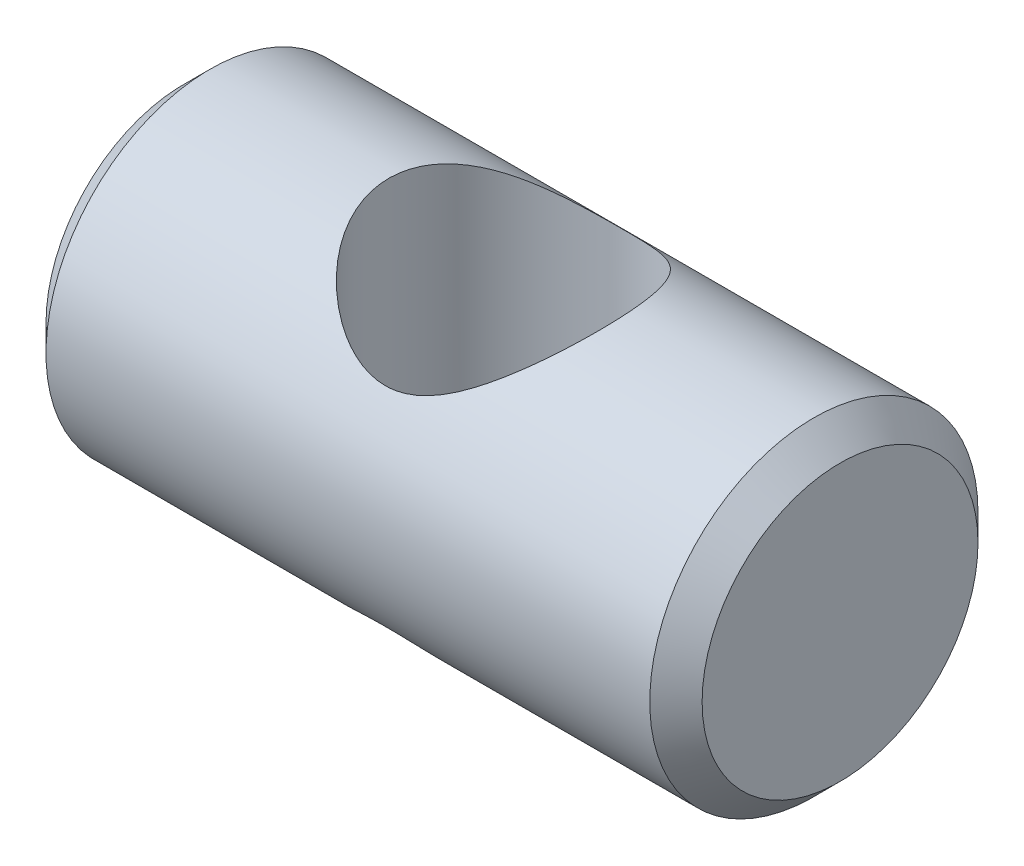
ISO-10303-21;
HEADER;
FILE_DESCRIPTION(('STEP AP214'),'2;1');
FILE_NAME('part.step','',(''),(''),'','','');
FILE_SCHEMA(('AUTOMOTIVE_DESIGN { 1 0 10303 214 1 1 1 1 }'));
ENDSEC;
DATA;
#1=APPLICATION_CONTEXT('core data for automotive mechanical design processes');
#2=APPLICATION_PROTOCOL_DEFINITION('international standard','automotive_design',2000,#1);
#3=PRODUCT_CONTEXT('',#1,'mechanical');
#4=PRODUCT('Part','Part','',(#3));
#5=PRODUCT_RELATED_PRODUCT_CATEGORY('part','',(#4));
#6=PRODUCT_DEFINITION_FORMATION('','',#4);
#7=PRODUCT_DEFINITION_CONTEXT('part definition',#1,'design');
#8=PRODUCT_DEFINITION('design','',#6,#7);
#9=PRODUCT_DEFINITION_SHAPE('','',#8);
#10=(LENGTH_UNIT() NAMED_UNIT(*) SI_UNIT(.MILLI.,.METRE.));
#11=(NAMED_UNIT(*) PLANE_ANGLE_UNIT() SI_UNIT($,.RADIAN.));
#12=(NAMED_UNIT(*) SI_UNIT($,.STERADIAN.) SOLID_ANGLE_UNIT());
#13=UNCERTAINTY_MEASURE_WITH_UNIT(LENGTH_MEASURE(1.E-05),#10,'distance_accuracy_value','');
#14=(GEOMETRIC_REPRESENTATION_CONTEXT(3) GLOBAL_UNCERTAINTY_ASSIGNED_CONTEXT((#13)) GLOBAL_UNIT_ASSIGNED_CONTEXT((#10,
#11,#12)) REPRESENTATION_CONTEXT('',''));
#15=CARTESIAN_POINT('',(0.,0.,0.));
#16=DIRECTION('',(0.,0.,1.));
#17=DIRECTION('',(1.,0.,0.));
#18=AXIS2_PLACEMENT_3D('',#15,#16,#17);
#19=CARTESIAN_POINT('',(9.525,0.,0.));
#20=DIRECTION('',(-1.,0.,0.));
#21=DIRECTION('',(0.,0.,1.));
#22=AXIS2_PLACEMENT_3D('',#19,#20,#21);
#23=CYLINDRICAL_SURFACE('',#22,4.765);
#24=CARTESIAN_POINT('',(0.,-3.0270158572429,3.68));
#25=CARTESIAN_POINT('',(0.0785672773316467,-3.02701614791727,3.67999984364138));
#26=CARTESIAN_POINT('',(0.157136135576355,-3.03031605642996,3.67729277636747));
#27=CARTESIAN_POINT('',(0.313369541449519,-3.04330147157753,3.66655295600809));
#28=CARTESIAN_POINT('',(0.391034010912772,-3.05298752605126,3.65851974601636));
#29=CARTESIAN_POINT('',(0.544942339151607,-3.07820352988238,3.63732812874269));
#30=CARTESIAN_POINT('',(0.621180877977562,-3.09375201630091,3.62415345944192));
#31=CARTESIAN_POINT('',(0.771468880528868,-3.12988210454059,3.59299821855179));
#32=CARTESIAN_POINT('',(0.845516665983408,-3.15046745848851,3.57501406328682));
#33=CARTESIAN_POINT('',(1.09433047382612,-3.22791462831318,3.50587087765695));
#34=CARTESIAN_POINT('',(1.26309282362243,-3.2948386580286,3.44382003292069));
#35=CARTESIAN_POINT('',(1.50370711041474,-3.40467601246938,3.33408533723918));
#36=CARTESIAN_POINT('',(1.58189244838755,-3.44290479326835,3.29468500807197));
#37=CARTESIAN_POINT('',(1.73423285237257,-3.52148653298938,3.21055545325705));
#38=CARTESIAN_POINT('',(1.80838881793449,-3.56183901380659,3.16582742418489));
#39=CARTESIAN_POINT('',(2.02850482582812,-3.68672600847629,3.02153691887044));
#40=CARTESIAN_POINT('',(2.16807869449588,-3.77315168849593,2.9137218740972));
#41=CARTESIAN_POINT('',(2.42959010373284,-3.94426933228633,2.67754924945123));
#42=CARTESIAN_POINT('',(2.55153658554773,-4.0289621561759,2.54920215427041));
#43=CARTESIAN_POINT('',(2.77693730786715,-4.1919505214112,2.27132648174837));
#44=CARTESIAN_POINT('',(2.88023478105728,-4.27018907543985,2.12163570850645));
#45=CARTESIAN_POINT('',(3.06369900830999,-4.41409842691616,1.80316374111448));
#46=CARTESIAN_POINT('',(3.14388622560065,-4.47978032533083,1.63439962117957));
#47=CARTESIAN_POINT('',(3.26635689009236,-4.58439476517905,1.30881127520956));
#48=CARTESIAN_POINT('',(3.3126324755552,-4.62591646772975,1.15433056577145));
#49=CARTESIAN_POINT('',(3.38325654959983,-4.69367027218436,0.83720228083025));
#50=CARTESIAN_POINT('',(3.40762001451853,-4.7199128126465,0.674560363681938));
#51=CARTESIAN_POINT('',(3.43267527752513,-4.75538994748078,0.345016918949483));
#52=CARTESIAN_POINT('',(3.43328564995364,-4.76456593536209,0.178102701594283));
#53=CARTESIAN_POINT('',(3.41018166140548,-4.76540378920208,-0.154080808504469));
#54=CARTESIAN_POINT('',(3.38646547727926,-4.75706434242047,-0.319349977022775));
#55=CARTESIAN_POINT('',(3.31775156953333,-4.72510260499364,-0.634317782486347));
#56=CARTESIAN_POINT('',(3.27397352746067,-4.70233080305011,-0.784375176401479));
#57=CARTESIAN_POINT('',(3.16750864597913,-4.64450941494238,-1.07505429218324));
#58=CARTESIAN_POINT('',(3.10481828431147,-4.60945754152293,-1.21567425043884));
#59=CARTESIAN_POINT('',(2.95652856255593,-4.52638674091887,-1.49677788855974));
#60=CARTESIAN_POINT('',(2.86942133720827,-4.47751111873768,-1.63620711351602));
#61=CARTESIAN_POINT('',(2.67788120319372,-4.37232420780869,-1.89951272145431));
#62=CARTESIAN_POINT('',(2.57343424063936,-4.31600689517522,-2.02337634423389));
#63=CARTESIAN_POINT('',(2.3299298971412,-4.18996971318213,-2.27426780979749));
#64=CARTESIAN_POINT('',(2.18800876851398,-4.11960732735628,-2.39819784816123));
#65=CARTESIAN_POINT('',(1.88505782163776,-3.98107848473248,-2.62174133186739));
#66=CARTESIAN_POINT('',(1.72402241690679,-3.91291267736107,-2.72134764203992));
#67=CARTESIAN_POINT('',(1.40961518716303,-3.79636450990898,-2.881168849186));
#68=CARTESIAN_POINT('',(1.25863725138286,-3.7465473111698,-2.94503209171547));
#69=CARTESIAN_POINT('',(0.945527440392475,-3.66060402226399,-3.05121747931763));
#70=CARTESIAN_POINT('',(0.783414037013451,-3.62445587601066,-3.09357436476774));
#71=CARTESIAN_POINT('',(0.53381305643861,-3.58476149841441,-3.13928376884266));
#72=CARTESIAN_POINT('',(0.449028547115522,-3.57393161480045,-3.15156761613341));
#73=CARTESIAN_POINT('',(0.278275024285709,-3.55780077117141,-3.16976872881678));
#74=CARTESIAN_POINT('',(0.192306660171832,-3.5524968934398,-3.17568935402606));
#75=CARTESIAN_POINT('',(0.0200327709043123,-3.54772147962291,-3.18102355866001));
#76=CARTESIAN_POINT('',(-0.0662726316081475,-3.54824798964232,-3.18043931801256));
#77=CARTESIAN_POINT('',(-0.238338872801629,-3.55508375410915,-3.17279435887041));
#78=CARTESIAN_POINT('',(-0.324099748085627,-3.56139261563451,-3.16573408043507));
#79=CARTESIAN_POINT('',(-0.553401842306178,-3.58576306843395,-3.13816835119393));
#80=CARTESIAN_POINT('',(-0.695739197403445,-3.60894237647337,-3.11173256017326));
#81=CARTESIAN_POINT('',(-0.973480788870412,-3.6678298405413,-3.04208625520151));
#82=CARTESIAN_POINT('',(-1.10887734054378,-3.70355155394913,-2.99885758403296));
#83=CARTESIAN_POINT('',(-1.42379146726814,-3.7997001514418,-2.87675019956371));
#84=CARTESIAN_POINT('',(-1.59919673865542,-3.86428769996493,-2.79052654374781));
#85=CARTESIAN_POINT('',(-1.93113815119942,-4.00059813210694,-2.59133845951309));
#86=CARTESIAN_POINT('',(-2.08764088718698,-4.07233325050109,-2.47832770642991));
#87=CARTESIAN_POINT('',(-2.38199709911894,-4.21579037939226,-2.22570370446708));
#88=CARTESIAN_POINT('',(-2.51955338419097,-4.28749766673045,-2.08573466326166));
#89=CARTESIAN_POINT('',(-2.77028243502779,-4.42234806198233,-1.78201502187867));
#90=CARTESIAN_POINT('',(-2.88349257282064,-4.48550424008068,-1.61830152645774));
#91=CARTESIAN_POINT('',(-3.06402610957439,-4.58658548395503,-1.30045140866569));
#92=CARTESIAN_POINT('',(-3.13591982023922,-4.62699541781642,-1.1497087789086));
#93=CARTESIAN_POINT('',(-3.25766051296821,-4.69370617156705,-0.836599849304387));
#94=CARTESIAN_POINT('',(-3.30752205037566,-4.7200163088041,-0.674241306034804));
#95=CARTESIAN_POINT('',(-3.3829870904449,-4.75572615385405,-0.341241432427479));
#96=CARTESIAN_POINT('',(-3.40846923089666,-4.7650414665297,-0.170563063438741));
#97=CARTESIAN_POINT('',(-3.4334390909829,-4.76495829995348,0.172677006169811));
#98=CARTESIAN_POINT('',(-3.43293306367628,-4.7555643228997,0.345238243758838));
#99=CARTESIAN_POINT('',(-3.40754400048731,-4.71998636563285,0.672126495727842));
#100=CARTESIAN_POINT('',(-3.38468468821344,-4.69525837988108,0.826779473459493));
#101=CARTESIAN_POINT('',(-3.31910619707247,-4.63193340521078,1.12882616508402));
#102=CARTESIAN_POINT('',(-3.27638180384756,-4.59333277548538,1.27621796175838));
#103=CARTESIAN_POINT('',(-3.17042951924722,-4.50215126554465,1.5686260572414));
#104=CARTESIAN_POINT('',(-3.10621371599284,-4.4489247354207,1.71307815224115));
#105=CARTESIAN_POINT('',(-2.96073945861412,-4.33272638873523,1.98874620073682));
#106=CARTESIAN_POINT('',(-2.87947919610231,-4.26975353829207,2.11996074756245));
#107=CARTESIAN_POINT('',(-2.68651050838254,-4.12556821291774,2.39003735747662));
#108=CARTESIAN_POINT('',(-2.57196063848181,-4.04309554925752,2.52618739114483));
#109=CARTESIAN_POINT('',(-2.32447412944916,-3.87408431941462,2.77844859407009));
#110=CARTESIAN_POINT('',(-2.19149095139183,-3.78753584009048,2.89450731580785));
#111=CARTESIAN_POINT('',(-1.96595276183287,-3.65130486353125,3.06263487303052));
#112=CARTESIAN_POINT('',(-1.87886470860018,-3.60090149373494,3.12157066922301));
#113=CARTESIAN_POINT('',(-1.69862262017004,-3.50236607543004,3.23173475735497));
#114=CARTESIAN_POINT('',(-1.60546616441238,-3.45423494663789,3.28295994638552));
#115=CARTESIAN_POINT('',(-1.41335402823623,-3.36225362869259,3.37709887635029));
#116=CARTESIAN_POINT('',(-1.31441341048654,-3.31839304937429,3.4200330530899));
#117=CARTESIAN_POINT('',(-1.11061583662532,-3.23713845030014,3.49704051581634));
#118=CARTESIAN_POINT('',(-1.00576424358736,-3.19973868995705,3.53112168161428));
#119=CARTESIAN_POINT('',(-0.826860618617416,-3.1451674862639,3.57966454279998));
#120=CARTESIAN_POINT('',(-0.754330914941612,-3.12542579098052,3.59686794878708));
#121=CARTESIAN_POINT('',(-0.607204587985835,-3.09080711138969,3.62665947956898));
#122=CARTESIAN_POINT('',(-0.532609008476298,-3.07592771737776,3.63924989089071));
#123=CARTESIAN_POINT('',(-0.382096659839412,-3.05181598122002,3.65949364139542));
#124=CARTESIAN_POINT('',(-0.306185151895194,-3.04256489437812,3.66716337327478));
#125=CARTESIAN_POINT('',(-0.153516252829605,-3.03016475948479,3.67741657137031));
#126=CARTESIAN_POINT('',(-0.0767588809019637,-3.02701557325904,3.68000015275969));
#127=CARTESIAN_POINT('',(0.,-3.0270158572429,3.68));
#128=B_SPLINE_CURVE_WITH_KNOTS('',3,(#24,#25,#26,#27,#28,#29,#30,#31,#32,#33,#34,#35,#36,#37,
#38,#39,#40,#41,#42,#43,#44,#45,#46,#47,#48,#49,#50,#51,#52,#53,#54,#55,#56,#57,#58,#59,#60,#61,
#62,#63,#64,#65,#66,#67,#68,#69,#70,#71,#72,#73,#74,#75,#76,#77,#78,#79,#80,#81,#82,#83,#84,#85,
#86,#87,#88,#89,#90,#91,#92,#93,#94,#95,#96,#97,#98,#99,#100,#101,#102,#103,#104,#105,#106,#107,
#108,#109,#110,#111,#112,#113,#114,#115,#116,#117,#118,#119,#120,#121,#122,#123,#124,#125,#126,
#127),.UNSPECIFIED.,.T.,.F.,(4,2,2,2,2,2,2,2,2,2,2,2,2,2,2,2,2,2,2,2,2,2,2,2,2,2,2,2,2,2,2,2,2,
2,2,2,2,2,2,2,2,2,2,2,2,2,2,2,2,2,2,4),(0.,0.235591708988226,0.471203630963839,
0.707566894291257,0.944106771258297,1.51591397043088,1.80236618274396,2.08875418016066,
2.67592975620557,3.26280644257577,3.85440755326201,4.44548320346413,4.94292664174491,
5.44002983205938,5.93883694376225,6.43768144120932,6.9095606777859,7.38152785217115,
7.89413675044232,8.40716316586385,9.00813916387888,9.60929124216606,10.1214610992978,
10.6328009675269,10.8914987801306,11.1500599316432,11.4085344360666,11.6669913779457,
12.1048085655684,12.5431004643862,13.1573710774192,13.7727118402267,14.3968121302921,
15.0199474601663,15.5333029695888,16.0463188267164,16.5618754223646,17.077307969612,
17.550023970907,18.0228641248864,18.5213957266873,19.0199802486027,19.6062313855034,
20.1939905554461,20.5434646283834,20.8930789631276,21.2418202453876,21.5902500511245,
21.8213124314337,22.0522601254179,22.2824343920731,22.5126034464923),.UNSPECIFIED.);
#129=CARTESIAN_POINT('',(0.,-3.0270158572429,3.68));
#130=VERTEX_POINT('',#129);
#131=EDGE_CURVE('E44',#130,#130,#128,.T.);
#132=ORIENTED_EDGE('',*,*,#131,.T.);
#133=EDGE_LOOP('',(#132));
#134=FACE_BOUND('',#133,.T.);
#135=CARTESIAN_POINT('',(0.,3.0270158572429,3.68));
#136=CARTESIAN_POINT('',(-0.0785672773316465,3.02701614791727,3.67999984364138));
#137=CARTESIAN_POINT('',(-0.157136135576355,3.03031605642996,3.67729277636747));
#138=CARTESIAN_POINT('',(-0.313369541449519,3.04330147157753,3.66655295600809));
#139=CARTESIAN_POINT('',(-0.391034010912771,3.05298752605126,3.65851974601636));
#140=CARTESIAN_POINT('',(-0.544942339151605,3.07820352988238,3.63732812874269));
#141=CARTESIAN_POINT('',(-0.62118087797756,3.09375201630091,3.62415345944192));
#142=CARTESIAN_POINT('',(-0.771468880528865,3.12988210454059,3.59299821855179));
#143=CARTESIAN_POINT('',(-0.845516665983405,3.15046745848851,3.57501406328682));
#144=CARTESIAN_POINT('',(-1.09433047382612,3.22791462831318,3.50587087765695));
#145=CARTESIAN_POINT('',(-1.26309282362243,3.2948386580286,3.44382003292069));
#146=CARTESIAN_POINT('',(-1.50370711041474,3.40467601246938,3.33408533723919));
#147=CARTESIAN_POINT('',(-1.58189244838754,3.44290479326835,3.29468500807198));
#148=CARTESIAN_POINT('',(-1.73423285237257,3.52148653298938,3.21055545325705));
#149=CARTESIAN_POINT('',(-1.80838881793448,3.56183901380659,3.16582742418489));
#150=CARTESIAN_POINT('',(-2.02850482582811,3.68672600847628,3.02153691887044));
#151=CARTESIAN_POINT('',(-2.16807869449587,3.77315168849593,2.9137218740972));
#152=CARTESIAN_POINT('',(-2.42959010373283,3.94426933228632,2.67754924945124));
#153=CARTESIAN_POINT('',(-2.55153658554772,4.0289621561759,2.54920215427042));
#154=CARTESIAN_POINT('',(-2.77693730786715,4.1919505214112,2.27132648174838));
#155=CARTESIAN_POINT('',(-2.88023478105728,4.27018907543984,2.12163570850646));
#156=CARTESIAN_POINT('',(-3.06369900830999,4.41409842691616,1.80316374111449));
#157=CARTESIAN_POINT('',(-3.14388622560065,4.47978032533083,1.63439962117957));
#158=CARTESIAN_POINT('',(-3.26635689009236,4.58439476517905,1.30881127520957));
#159=CARTESIAN_POINT('',(-3.3126324755552,4.62591646772974,1.15433056577145));
#160=CARTESIAN_POINT('',(-3.38325654959983,4.69367027218436,0.837202280830257));
#161=CARTESIAN_POINT('',(-3.40762001451853,4.71991281264649,0.674560363681945));
#162=CARTESIAN_POINT('',(-3.43267527752513,4.75538994748078,0.345016918949489));
#163=CARTESIAN_POINT('',(-3.43328564995364,4.76456593536209,0.178102701594289));
#164=CARTESIAN_POINT('',(-3.41018166140548,4.76540378920208,-0.154080808504464));
#165=CARTESIAN_POINT('',(-3.38646547727926,4.75706434242047,-0.31934997702277));
#166=CARTESIAN_POINT('',(-3.31775156953333,4.72510260499364,-0.634317782486343));
#167=CARTESIAN_POINT('',(-3.27397352746067,4.70233080305011,-0.784375176401475));
#168=CARTESIAN_POINT('',(-3.16750864597913,4.64450941494238,-1.07505429218324));
#169=CARTESIAN_POINT('',(-3.10481828431148,4.60945754152293,-1.21567425043883));
#170=CARTESIAN_POINT('',(-2.95652856255593,4.52638674091888,-1.49677788855974));
#171=CARTESIAN_POINT('',(-2.86942133720827,4.47751111873768,-1.63620711351601));
#172=CARTESIAN_POINT('',(-2.67788120319372,4.37232420780869,-1.89951272145431));
#173=CARTESIAN_POINT('',(-2.57343424063936,4.31600689517522,-2.02337634423388));
#174=CARTESIAN_POINT('',(-2.32992989714121,4.18996971318213,-2.27426780979749));
#175=CARTESIAN_POINT('',(-2.18800876851398,4.11960732735628,-2.39819784816122));
#176=CARTESIAN_POINT('',(-1.88505782163776,3.98107848473248,-2.62174133186739));
#177=CARTESIAN_POINT('',(-1.72402241690679,3.91291267736107,-2.72134764203992));
#178=CARTESIAN_POINT('',(-1.40961518716303,3.79636450990898,-2.881168849186));
#179=CARTESIAN_POINT('',(-1.25863725138286,3.7465473111698,-2.94503209171546));
#180=CARTESIAN_POINT('',(-0.945527440392477,3.66060402226399,-3.05121747931762));
#181=CARTESIAN_POINT('',(-0.783414037013454,3.62445587601066,-3.09357436476774));
#182=CARTESIAN_POINT('',(-0.533813056438614,3.58476149841442,-3.13928376884266));
#183=CARTESIAN_POINT('',(-0.449028547115525,3.57393161480045,-3.15156761613341));
#184=CARTESIAN_POINT('',(-0.278275024285712,3.55780077117141,-3.16976872881678));
#185=CARTESIAN_POINT('',(-0.192306660171835,3.5524968934398,-3.17568935402606));
#186=CARTESIAN_POINT('',(-0.0200327709043162,3.54772147962291,-3.18102355866001));
#187=CARTESIAN_POINT('',(0.0662726316081432,3.54824798964232,-3.18043931801256));
#188=CARTESIAN_POINT('',(0.238338872801624,3.55508375410915,-3.17279435887041));
#189=CARTESIAN_POINT('',(0.324099748085623,3.56139261563451,-3.16573408043508));
#190=CARTESIAN_POINT('',(0.553401842306172,3.58576306843395,-3.13816835119393));
#191=CARTESIAN_POINT('',(0.69573919740344,3.60894237647337,-3.11173256017326));
#192=CARTESIAN_POINT('',(0.973480788870407,3.6678298405413,-3.04208625520151));
#193=CARTESIAN_POINT('',(1.10887734054378,3.70355155394912,-2.99885758403296));
#194=CARTESIAN_POINT('',(1.42379146726814,3.7997001514418,-2.87675019956372));
#195=CARTESIAN_POINT('',(1.59919673865541,3.86428769996493,-2.79052654374781));
#196=CARTESIAN_POINT('',(1.93113815119942,4.00059813210694,-2.59133845951309));
#197=CARTESIAN_POINT('',(2.08764088718698,4.07233325050109,-2.47832770642991));
#198=CARTESIAN_POINT('',(2.38199709911893,4.21579037939226,-2.22570370446708));
#199=CARTESIAN_POINT('',(2.51955338419097,4.28749766673045,-2.08573466326166));
#200=CARTESIAN_POINT('',(2.77028243502778,4.42234806198233,-1.78201502187867));
#201=CARTESIAN_POINT('',(2.88349257282064,4.48550424008068,-1.61830152645775));
#202=CARTESIAN_POINT('',(3.06402610957439,4.58658548395503,-1.30045140866569));
#203=CARTESIAN_POINT('',(3.13591982023922,4.62699541781642,-1.14970877890861));
#204=CARTESIAN_POINT('',(3.25766051296821,4.69370617156705,-0.836599849304392));
#205=CARTESIAN_POINT('',(3.30752205037566,4.7200163088041,-0.67424130603481));
#206=CARTESIAN_POINT('',(3.3829870904449,4.75572615385405,-0.341241432427484));
#207=CARTESIAN_POINT('',(3.40846923089666,4.7650414665297,-0.170563063438745));
#208=CARTESIAN_POINT('',(3.4334390909829,4.76495829995348,0.172677006169808));
#209=CARTESIAN_POINT('',(3.43293306367628,4.7555643228997,0.345238243758835));
#210=CARTESIAN_POINT('',(3.40754400048731,4.71998636563285,0.672126495727839));
#211=CARTESIAN_POINT('',(3.38468468821344,4.69525837988108,0.82677947345949));
#212=CARTESIAN_POINT('',(3.31910619707247,4.63193340521078,1.12882616508402));
#213=CARTESIAN_POINT('',(3.27638180384756,4.59333277548538,1.27621796175837));
#214=CARTESIAN_POINT('',(3.17042951924722,4.50215126554465,1.56862605724139));
#215=CARTESIAN_POINT('',(3.10621371599284,4.4489247354207,1.71307815224114));
#216=CARTESIAN_POINT('',(2.96073945861412,4.33272638873523,1.98874620073681));
#217=CARTESIAN_POINT('',(2.87947919610232,4.26975353829207,2.11996074756245));
#218=CARTESIAN_POINT('',(2.68651050838254,4.12556821291774,2.39003735747662));
#219=CARTESIAN_POINT('',(2.57196063848181,4.04309554925752,2.52618739114482));
#220=CARTESIAN_POINT('',(2.32447412944917,3.87408431941462,2.77844859407009));
#221=CARTESIAN_POINT('',(2.19149095139184,3.78753584009048,2.89450731580784));
#222=CARTESIAN_POINT('',(1.96595276183287,3.65130486353125,3.06263487303052));
#223=CARTESIAN_POINT('',(1.87886470860019,3.60090149373494,3.12157066922301));
#224=CARTESIAN_POINT('',(1.69862262017005,3.50236607543005,3.23173475735497));
#225=CARTESIAN_POINT('',(1.60546616441238,3.45423494663789,3.28295994638551));
#226=CARTESIAN_POINT('',(1.41335402823624,3.36225362869259,3.37709887635029));
#227=CARTESIAN_POINT('',(1.31441341048654,3.31839304937429,3.4200330530899));
#228=CARTESIAN_POINT('',(1.11061583662532,3.23713845030014,3.49704051581634));
#229=CARTESIAN_POINT('',(1.00576424358737,3.19973868995705,3.53112168161428));
#230=CARTESIAN_POINT('',(0.82686061861742,3.1451674862639,3.57966454279998));
#231=CARTESIAN_POINT('',(0.754330914941614,3.12542579098052,3.59686794878708));
#232=CARTESIAN_POINT('',(0.607204587985836,3.09080711138969,3.62665947956898));
#233=CARTESIAN_POINT('',(0.532609008476299,3.07592771737776,3.63924989089071));
#234=CARTESIAN_POINT('',(0.382096659839412,3.05181598122002,3.65949364139542));
#235=CARTESIAN_POINT('',(0.306185151895194,3.04256489437811,3.66716337327478));
#236=CARTESIAN_POINT('',(0.153516252829605,3.03016475948479,3.67741657137031));
#237=CARTESIAN_POINT('',(0.0767588809019639,3.02701557325904,3.68000015275969));
#238=CARTESIAN_POINT('',(0.,3.0270158572429,3.68));
#239=B_SPLINE_CURVE_WITH_KNOTS('',3,(#135,#136,#137,#138,#139,#140,#141,#142,#143,#144,#145,
#146,#147,#148,#149,#150,#151,#152,#153,#154,#155,#156,#157,#158,#159,#160,#161,#162,#163,#164,
#165,#166,#167,#168,#169,#170,#171,#172,#173,#174,#175,#176,#177,#178,#179,#180,#181,#182,#183,
#184,#185,#186,#187,#188,#189,#190,#191,#192,#193,#194,#195,#196,#197,#198,#199,#200,#201,#202,
#203,#204,#205,#206,#207,#208,#209,#210,#211,#212,#213,#214,#215,#216,#217,#218,#219,#220,#221,
#222,#223,#224,#225,#226,#227,#228,#229,#230,#231,#232,#233,#234,#235,#236,#237,#238),
.UNSPECIFIED.,.T.,.F.,(4,2,2,2,2,2,2,2,2,2,2,2,2,2,2,2,2,2,2,2,2,2,2,2,2,2,2,2,2,2,2,2,2,2,2,2,
2,2,2,2,2,2,2,2,2,2,2,2,2,2,2,4),(0.,0.235591708988226,0.471203630963838,0.707566894291255,
0.944106771258294,1.51591397043087,1.80236618274396,2.08875418016066,2.67592975620556,
3.26280644257576,3.854407553262,4.44548320346412,4.94292664174491,5.44002983205938,
5.93883694376224,6.43768144120931,6.9095606777859,7.38152785217115,7.89413675044232,
8.40716316586385,9.00813916387887,9.60929124216605,10.1214610992978,10.6328009675269,
10.8914987801306,11.1500599316432,11.4085344360666,11.6669913779457,12.1048085655684,
12.5431004643861,13.1573710774192,13.7727118402267,14.3968121302921,15.0199474601663,
15.5333029695888,16.0463188267164,16.5618754223646,17.077307969612,17.550023970907,
18.0228641248864,18.5213957266873,19.0199802486027,19.6062313855034,20.1939905554461,
20.5434646283834,20.8930789631276,21.2418202453876,21.5902500511245,21.8213124314337,
22.0522601254179,22.2824343920731,22.5126034464923),.UNSPECIFIED.);
#240=CARTESIAN_POINT('',(0.,3.0270158572429,3.68));
#241=VERTEX_POINT('',#240);
#242=EDGE_CURVE('E63',#241,#241,#239,.T.);
#243=ORIENTED_EDGE('',*,*,#242,.T.);
#244=EDGE_LOOP('',(#243));
#245=FACE_BOUND('',#244,.T.);
#246=CARTESIAN_POINT('',(-8.76499999999999,0.,0.));
#247=DIRECTION('',(1.,0.,0.));
#248=DIRECTION('',(0.,0.,-1.));
#249=AXIS2_PLACEMENT_3D('',#246,#247,#248);
#250=CIRCLE('',#249,4.765);
#251=CARTESIAN_POINT('',(-8.76499999999999,0.,-4.765));
#252=VERTEX_POINT('',#251);
#253=EDGE_CURVE('E60',#252,#252,#250,.T.);
#254=ORIENTED_EDGE('',*,*,#253,.T.);
#255=EDGE_LOOP('',(#254));
#256=FACE_BOUND('',#255,.T.);
#257=CARTESIAN_POINT('',(8.76500000000001,0.,0.));
#258=DIRECTION('',(1.,0.,0.));
#259=DIRECTION('',(0.,0.,-1.));
#260=AXIS2_PLACEMENT_3D('',#257,#258,#259);
#261=CIRCLE('',#260,4.765);
#262=CARTESIAN_POINT('',(8.76500000000001,0.,-4.765));
#263=VERTEX_POINT('',#262);
#264=EDGE_CURVE('E101',#263,#263,#261,.F.);
#265=ORIENTED_EDGE('',*,*,#264,.T.);
#266=EDGE_LOOP('',(#265));
#267=FACE_BOUND('',#266,.T.);
#268=ADVANCED_FACE('F39',(#134,#245,#256,#267),#23,.T.);
#269=CARTESIAN_POINT('',(9.525,0.,0.));
#270=DIRECTION('',(1.,0.,0.));
#271=DIRECTION('',(0.,0.,-1.));
#272=AXIS2_PLACEMENT_3D('',#269,#270,#271);
#273=PLANE('',#272);
#274=CARTESIAN_POINT('',(9.525,0.,0.));
#275=DIRECTION('',(1.,0.,0.));
#276=DIRECTION('',(0.,0.,-1.));
#277=AXIS2_PLACEMENT_3D('',#274,#275,#276);
#278=CIRCLE('',#277,4.00500000000001);
#279=CARTESIAN_POINT('',(9.525,0.,-4.00500000000001));
#280=VERTEX_POINT('',#279);
#281=EDGE_CURVE('E10',#280,#280,#278,.T.);
#282=ORIENTED_EDGE('',*,*,#281,.T.);
#283=EDGE_LOOP('',(#282));
#284=FACE_BOUND('',#283,.T.);
#285=ADVANCED_FACE('F76',(#284),#273,.T.);
#286=CARTESIAN_POINT('',(-9.525,0.,0.));
#287=DIRECTION('',(1.,0.,0.));
#288=DIRECTION('',(0.,0.,-1.));
#289=AXIS2_PLACEMENT_3D('',#286,#287,#288);
#290=PLANE('',#289);
#291=CARTESIAN_POINT('',(-9.525,0.,0.));
#292=DIRECTION('',(1.,0.,0.));
#293=DIRECTION('',(0.,0.,-1.));
#294=AXIS2_PLACEMENT_3D('',#291,#292,#293);
#295=CIRCLE('',#294,4.00499999999998);
#296=CARTESIAN_POINT('',(-9.525,0.,-4.00499999999998));
#297=VERTEX_POINT('',#296);
#298=EDGE_CURVE('E54',#297,#297,#295,.F.);
#299=ORIENTED_EDGE('',*,*,#298,.T.);
#300=EDGE_LOOP('',(#299));
#301=FACE_BOUND('',#300,.T.);
#302=ADVANCED_FACE('F79',(#301),#290,.F.);
#303=CARTESIAN_POINT('',(-8.76499999999999,0.,0.));
#304=DIRECTION('',(1.,0.,0.));
#305=DIRECTION('',(0.,0.,-1.));
#306=AXIS2_PLACEMENT_3D('',#303,#304,#305);
#307=CONICAL_SURFACE('',#306,4.765,0.78539816339745);
#308=ORIENTED_EDGE('',*,*,#298,.F.);
#309=EDGE_LOOP('',(#308));
#310=FACE_BOUND('',#309,.T.);
#311=ORIENTED_EDGE('',*,*,#253,.F.);
#312=EDGE_LOOP('',(#311));
#313=FACE_BOUND('',#312,.T.);
#314=ADVANCED_FACE('F81',(#310,#313),#307,.T.);
#315=CARTESIAN_POINT('',(9.525,0.,0.));
#316=DIRECTION('',(-1.,0.,0.));
#317=DIRECTION('',(0.,0.,1.));
#318=AXIS2_PLACEMENT_3D('',#315,#316,#317);
#319=CONICAL_SURFACE('',#318,4.00500000000001,0.785398163397449);
#320=ORIENTED_EDGE('',*,*,#264,.F.);
#321=EDGE_LOOP('',(#320));
#322=FACE_BOUND('',#321,.T.);
#323=ORIENTED_EDGE('',*,*,#281,.F.);
#324=EDGE_LOOP('',(#323));
#325=FACE_BOUND('',#324,.T.);
#326=ADVANCED_FACE('F42',(#322,#325),#319,.T.);
#327=CARTESIAN_POINT('',(0.,-9.525,0.25));
#328=DIRECTION('',(0.,1.,0.));
#329=DIRECTION('',(0.,0.,1.));
#330=AXIS2_PLACEMENT_3D('',#327,#328,#329);
#331=CYLINDRICAL_SURFACE('',#330,3.43);
#332=ORIENTED_EDGE('',*,*,#242,.F.);
#333=EDGE_LOOP('',(#332));
#334=FACE_BOUND('',#333,.T.);
#335=ORIENTED_EDGE('',*,*,#131,.F.);
#336=EDGE_LOOP('',(#335));
#337=FACE_BOUND('',#336,.T.);
#338=ADVANCED_FACE('F71',(#334,#337),#331,.F.);
#339=CLOSED_SHELL('',(#268,#285,#302,#314,#326,#338));
#340=MANIFOLD_SOLID_BREP('B2',#339);
#341=ADVANCED_BREP_SHAPE_REPRESENTATION('',(#18,#340),#14);
#342=SHAPE_DEFINITION_REPRESENTATION(#9,#341);
ENDSEC;
END-ISO-10303-21;
